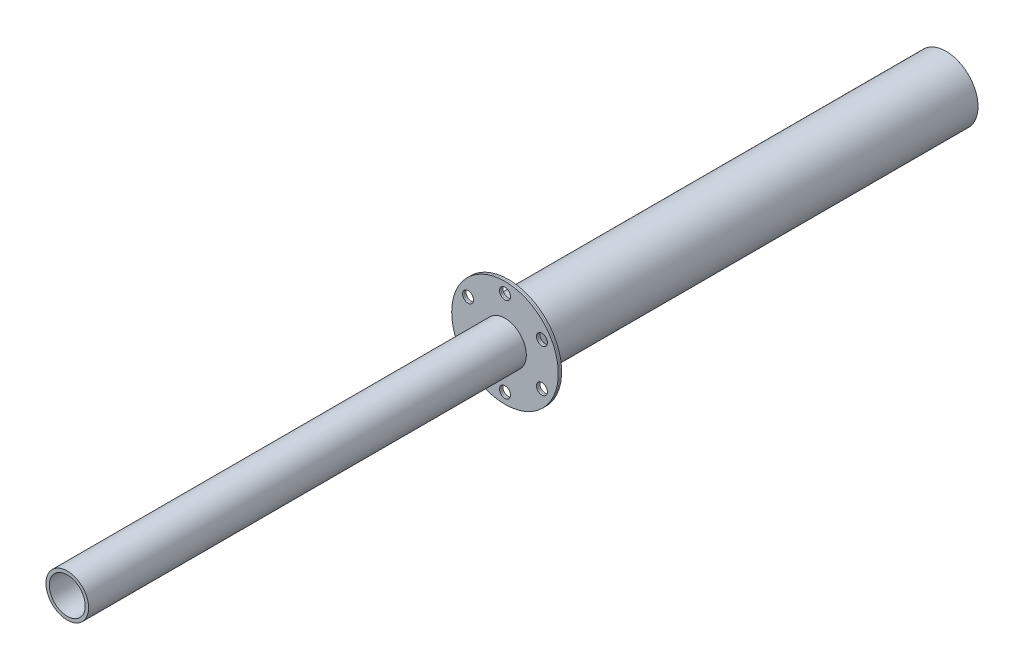
ISO-10303-21;
HEADER;
FILE_DESCRIPTION(('STEP AP214'),'2;1');
FILE_NAME('part.step','',(''),(''),'','','');
FILE_SCHEMA(('AUTOMOTIVE_DESIGN { 1 0 10303 214 1 1 1 1 }'));
ENDSEC;
DATA;
#1=APPLICATION_CONTEXT('core data for automotive mechanical design processes');
#2=APPLICATION_PROTOCOL_DEFINITION('international standard','automotive_design',2000,#1);
#3=PRODUCT_CONTEXT('',#1,'mechanical');
#4=PRODUCT('Part','Part','',(#3));
#5=PRODUCT_RELATED_PRODUCT_CATEGORY('part','',(#4));
#6=PRODUCT_DEFINITION_FORMATION('','',#4);
#7=PRODUCT_DEFINITION_CONTEXT('part definition',#1,'design');
#8=PRODUCT_DEFINITION('design','',#6,#7);
#9=PRODUCT_DEFINITION_SHAPE('','',#8);
#10=(LENGTH_UNIT() NAMED_UNIT(*) SI_UNIT(.MILLI.,.METRE.));
#11=(NAMED_UNIT(*) PLANE_ANGLE_UNIT() SI_UNIT($,.RADIAN.));
#12=(NAMED_UNIT(*) SI_UNIT($,.STERADIAN.) SOLID_ANGLE_UNIT());
#13=UNCERTAINTY_MEASURE_WITH_UNIT(LENGTH_MEASURE(1.E-05),#10,'distance_accuracy_value','');
#14=(GEOMETRIC_REPRESENTATION_CONTEXT(3) GLOBAL_UNCERTAINTY_ASSIGNED_CONTEXT((#13)) GLOBAL_UNIT_ASSIGNED_CONTEXT((#10,
#11,#12)) REPRESENTATION_CONTEXT('',''));
#15=CARTESIAN_POINT('',(0.,0.,0.));
#16=DIRECTION('',(0.,0.,1.));
#17=DIRECTION('',(1.,0.,0.));
#18=AXIS2_PLACEMENT_3D('',#15,#16,#17);
#19=CARTESIAN_POINT('',(0.,0.,-262.7));
#20=DIRECTION('',(0.,0.,-1.));
#21=DIRECTION('',(-1.,0.,0.));
#22=AXIS2_PLACEMENT_3D('',#19,#20,#21);
#23=PLANE('',#22);
#24=CARTESIAN_POINT('',(0.,-25.4,-262.7));
#25=DIRECTION('',(0.,0.,-1.));
#26=DIRECTION('',(-1.,0.,0.));
#27=AXIS2_PLACEMENT_3D('',#24,#25,#26);
#28=CIRCLE('',#27,3.2639);
#29=CARTESIAN_POINT('',(-3.26390000000001,-25.4,-262.7));
#30=VERTEX_POINT('',#29);
#31=EDGE_CURVE('E83',#30,#30,#28,.T.);
#32=ORIENTED_EDGE('',*,*,#31,.F.);
#33=EDGE_LOOP('',(#32));
#34=FACE_BOUND('',#33,.T.);
#35=CARTESIAN_POINT('',(-21.9970452561247,12.7,-262.7));
#36=DIRECTION('',(0.,0.,-1.));
#37=DIRECTION('',(-1.,0.,0.));
#38=AXIS2_PLACEMENT_3D('',#35,#36,#37);
#39=CIRCLE('',#38,3.2639);
#40=CARTESIAN_POINT('',(-25.2609452561247,12.7,-262.7));
#41=VERTEX_POINT('',#40);
#42=EDGE_CURVE('E71',#41,#41,#39,.T.);
#43=ORIENTED_EDGE('',*,*,#42,.F.);
#44=EDGE_LOOP('',(#43));
#45=FACE_BOUND('',#44,.T.);
#46=CARTESIAN_POINT('',(0.,25.4,-262.7));
#47=DIRECTION('',(0.,0.,-1.));
#48=DIRECTION('',(-1.,0.,0.));
#49=AXIS2_PLACEMENT_3D('',#46,#47,#48);
#50=CIRCLE('',#49,3.2639);
#51=CARTESIAN_POINT('',(-3.2639,25.4,-262.7));
#52=VERTEX_POINT('',#51);
#53=EDGE_CURVE('E59',#52,#52,#50,.T.);
#54=ORIENTED_EDGE('',*,*,#53,.F.);
#55=EDGE_LOOP('',(#54));
#56=FACE_BOUND('',#55,.T.);
#57=CARTESIAN_POINT('',(0.,0.,-262.7));
#58=DIRECTION('',(0.,0.,-1.));
#59=DIRECTION('',(-1.,0.,0.));
#60=AXIS2_PLACEMENT_3D('',#57,#58,#59);
#61=CIRCLE('',#60,31.75);
#62=CARTESIAN_POINT('',(-31.75,0.,-262.7));
#63=VERTEX_POINT('',#62);
#64=EDGE_CURVE('E11',#63,#63,#61,.T.);
#65=ORIENTED_EDGE('',*,*,#64,.T.);
#66=EDGE_LOOP('',(#65));
#67=FACE_BOUND('',#66,.T.);
#68=CARTESIAN_POINT('',(21.9970452561247,12.7,-262.7));
#69=DIRECTION('',(0.,0.,-1.));
#70=DIRECTION('',(-1.,0.,0.));
#71=AXIS2_PLACEMENT_3D('',#68,#69,#70);
#72=CIRCLE('',#71,3.2639);
#73=CARTESIAN_POINT('',(18.7331452561247,12.7,-262.7));
#74=VERTEX_POINT('',#73);
#75=EDGE_CURVE('E54',#74,#74,#72,.T.);
#76=ORIENTED_EDGE('',*,*,#75,.F.);
#77=EDGE_LOOP('',(#76));
#78=FACE_BOUND('',#77,.T.);
#79=CARTESIAN_POINT('',(21.9970452561247,-12.7,-262.7));
#80=DIRECTION('',(0.,0.,-1.));
#81=DIRECTION('',(-1.,0.,0.));
#82=AXIS2_PLACEMENT_3D('',#79,#80,#81);
#83=CIRCLE('',#82,3.2639);
#84=CARTESIAN_POINT('',(18.7331452561247,-12.7,-262.7));
#85=VERTEX_POINT('',#84);
#86=EDGE_CURVE('E65',#85,#85,#83,.T.);
#87=ORIENTED_EDGE('',*,*,#86,.F.);
#88=EDGE_LOOP('',(#87));
#89=FACE_BOUND('',#88,.T.);
#90=CARTESIAN_POINT('',(-21.9970452561248,-12.7,-262.7));
#91=DIRECTION('',(0.,0.,-1.));
#92=DIRECTION('',(-1.,0.,0.));
#93=AXIS2_PLACEMENT_3D('',#90,#91,#92);
#94=CIRCLE('',#93,3.2639);
#95=CARTESIAN_POINT('',(-25.2609452561248,-12.7,-262.7));
#96=VERTEX_POINT('',#95);
#97=EDGE_CURVE('E77',#96,#96,#94,.T.);
#98=ORIENTED_EDGE('',*,*,#97,.F.);
#99=EDGE_LOOP('',(#98));
#100=FACE_BOUND('',#99,.T.);
#101=CARTESIAN_POINT('',(0.,0.,-262.7));
#102=DIRECTION('',(0.,0.,-1.));
#103=DIRECTION('',(-1.,0.,0.));
#104=AXIS2_PLACEMENT_3D('',#101,#102,#103);
#105=CIRCLE('',#104,19.05);
#106=CARTESIAN_POINT('',(-19.05,0.,-262.7));
#107=VERTEX_POINT('',#106);
#108=EDGE_CURVE('E89',#107,#107,#105,.T.);
#109=ORIENTED_EDGE('',*,*,#108,.F.);
#110=EDGE_LOOP('',(#109));
#111=FACE_BOUND('',#110,.T.);
#112=ADVANCED_FACE('F43',(#34,#45,#56,#67,#78,#89,#100,#111),#23,.T.);
#113=CARTESIAN_POINT('',(0.,0.,-261.7));
#114=DIRECTION('',(0.,0.,-1.));
#115=DIRECTION('',(-1.,0.,0.));
#116=AXIS2_PLACEMENT_3D('',#113,#114,#115);
#117=PLANE('',#116);
#118=CARTESIAN_POINT('',(0.,-25.4,-261.7));
#119=DIRECTION('',(0.,0.,-1.));
#120=DIRECTION('',(-1.,0.,0.));
#121=AXIS2_PLACEMENT_3D('',#118,#119,#120);
#122=CIRCLE('',#121,3.2639);
#123=CARTESIAN_POINT('',(-3.26390000000001,-25.4,-261.7));
#124=VERTEX_POINT('',#123);
#125=EDGE_CURVE('E86',#124,#124,#122,.T.);
#126=ORIENTED_EDGE('',*,*,#125,.T.);
#127=EDGE_LOOP('',(#126));
#128=FACE_BOUND('',#127,.T.);
#129=CARTESIAN_POINT('',(-21.9970452561247,12.7,-261.7));
#130=DIRECTION('',(0.,0.,-1.));
#131=DIRECTION('',(-1.,0.,0.));
#132=AXIS2_PLACEMENT_3D('',#129,#130,#131);
#133=CIRCLE('',#132,3.2639);
#134=CARTESIAN_POINT('',(-25.2609452561247,12.7,-261.7));
#135=VERTEX_POINT('',#134);
#136=EDGE_CURVE('E74',#135,#135,#133,.T.);
#137=ORIENTED_EDGE('',*,*,#136,.T.);
#138=EDGE_LOOP('',(#137));
#139=FACE_BOUND('',#138,.T.);
#140=CARTESIAN_POINT('',(0.,25.4,-261.7));
#141=DIRECTION('',(0.,0.,-1.));
#142=DIRECTION('',(-1.,0.,0.));
#143=AXIS2_PLACEMENT_3D('',#140,#141,#142);
#144=CIRCLE('',#143,3.2639);
#145=CARTESIAN_POINT('',(-3.2639,25.4,-261.7));
#146=VERTEX_POINT('',#145);
#147=EDGE_CURVE('E62',#146,#146,#144,.T.);
#148=ORIENTED_EDGE('',*,*,#147,.T.);
#149=EDGE_LOOP('',(#148));
#150=FACE_BOUND('',#149,.T.);
#151=CARTESIAN_POINT('',(0.,0.,-261.7));
#152=DIRECTION('',(0.,0.,-1.));
#153=DIRECTION('',(-1.,0.,0.));
#154=AXIS2_PLACEMENT_3D('',#151,#152,#153);
#155=CIRCLE('',#154,31.75);
#156=CARTESIAN_POINT('',(-31.75,0.,-261.7));
#157=VERTEX_POINT('',#156);
#158=EDGE_CURVE('E47',#157,#157,#155,.T.);
#159=ORIENTED_EDGE('',*,*,#158,.F.);
#160=EDGE_LOOP('',(#159));
#161=FACE_BOUND('',#160,.T.);
#162=CARTESIAN_POINT('',(21.9970452561247,12.7,-261.7));
#163=DIRECTION('',(0.,0.,-1.));
#164=DIRECTION('',(-1.,0.,0.));
#165=AXIS2_PLACEMENT_3D('',#162,#163,#164);
#166=CIRCLE('',#165,3.2639);
#167=CARTESIAN_POINT('',(18.7331452561247,12.7,-261.7));
#168=VERTEX_POINT('',#167);
#169=EDGE_CURVE('E56',#168,#168,#166,.T.);
#170=ORIENTED_EDGE('',*,*,#169,.T.);
#171=EDGE_LOOP('',(#170));
#172=FACE_BOUND('',#171,.T.);
#173=CARTESIAN_POINT('',(21.9970452561247,-12.7,-261.7));
#174=DIRECTION('',(0.,0.,-1.));
#175=DIRECTION('',(-1.,0.,0.));
#176=AXIS2_PLACEMENT_3D('',#173,#174,#175);
#177=CIRCLE('',#176,3.2639);
#178=CARTESIAN_POINT('',(18.7331452561247,-12.7,-261.7));
#179=VERTEX_POINT('',#178);
#180=EDGE_CURVE('E68',#179,#179,#177,.T.);
#181=ORIENTED_EDGE('',*,*,#180,.T.);
#182=EDGE_LOOP('',(#181));
#183=FACE_BOUND('',#182,.T.);
#184=CARTESIAN_POINT('',(-21.9970452561248,-12.7,-261.7));
#185=DIRECTION('',(0.,0.,-1.));
#186=DIRECTION('',(-1.,0.,0.));
#187=AXIS2_PLACEMENT_3D('',#184,#185,#186);
#188=CIRCLE('',#187,3.2639);
#189=CARTESIAN_POINT('',(-25.2609452561248,-12.7,-261.7));
#190=VERTEX_POINT('',#189);
#191=EDGE_CURVE('E80',#190,#190,#188,.T.);
#192=ORIENTED_EDGE('',*,*,#191,.T.);
#193=EDGE_LOOP('',(#192));
#194=FACE_BOUND('',#193,.T.);
#195=CARTESIAN_POINT('',(0.,0.,-261.7));
#196=DIRECTION('',(0.,0.,-1.));
#197=DIRECTION('',(-1.,0.,0.));
#198=AXIS2_PLACEMENT_3D('',#195,#196,#197);
#199=CIRCLE('',#198,19.05);
#200=CARTESIAN_POINT('',(-19.05,0.,-261.7));
#201=VERTEX_POINT('',#200);
#202=EDGE_CURVE('E92',#201,#201,#199,.T.);
#203=ORIENTED_EDGE('',*,*,#202,.T.);
#204=EDGE_LOOP('',(#203));
#205=FACE_BOUND('',#204,.T.);
#206=ADVANCED_FACE('F102',(#128,#139,#150,#161,#172,#183,#194,#205),#117,.F.);
#207=CARTESIAN_POINT('',(0.,0.,-262.7));
#208=DIRECTION('',(0.,0.,1.));
#209=DIRECTION('',(1.,0.,0.));
#210=AXIS2_PLACEMENT_3D('',#207,#208,#209);
#211=CYLINDRICAL_SURFACE('',#210,31.75);
#212=ORIENTED_EDGE('',*,*,#64,.F.);
#213=EDGE_LOOP('',(#212));
#214=FACE_BOUND('',#213,.T.);
#215=ORIENTED_EDGE('',*,*,#158,.T.);
#216=EDGE_LOOP('',(#215));
#217=FACE_BOUND('',#216,.T.);
#218=ADVANCED_FACE('F45',(#214,#217),#211,.T.);
#219=CARTESIAN_POINT('',(21.9970452561247,12.7,-262.7));
#220=DIRECTION('',(0.,0.,1.));
#221=DIRECTION('',(1.,0.,0.));
#222=AXIS2_PLACEMENT_3D('',#219,#220,#221);
#223=CYLINDRICAL_SURFACE('',#222,3.2639);
#224=ORIENTED_EDGE('',*,*,#75,.T.);
#225=EDGE_LOOP('',(#224));
#226=FACE_BOUND('',#225,.T.);
#227=ORIENTED_EDGE('',*,*,#169,.F.);
#228=EDGE_LOOP('',(#227));
#229=FACE_BOUND('',#228,.T.);
#230=ADVANCED_FACE('F112',(#226,#229),#223,.F.);
#231=CARTESIAN_POINT('',(0.,25.4,-262.7));
#232=DIRECTION('',(0.,0.,1.));
#233=DIRECTION('',(1.,0.,0.));
#234=AXIS2_PLACEMENT_3D('',#231,#232,#233);
#235=CYLINDRICAL_SURFACE('',#234,3.2639);
#236=ORIENTED_EDGE('',*,*,#53,.T.);
#237=EDGE_LOOP('',(#236));
#238=FACE_BOUND('',#237,.T.);
#239=ORIENTED_EDGE('',*,*,#147,.F.);
#240=EDGE_LOOP('',(#239));
#241=FACE_BOUND('',#240,.T.);
#242=ADVANCED_FACE('F115',(#238,#241),#235,.F.);
#243=CARTESIAN_POINT('',(21.9970452561247,-12.7,-262.7));
#244=DIRECTION('',(0.,0.,1.));
#245=DIRECTION('',(1.,0.,0.));
#246=AXIS2_PLACEMENT_3D('',#243,#244,#245);
#247=CYLINDRICAL_SURFACE('',#246,3.2639);
#248=ORIENTED_EDGE('',*,*,#86,.T.);
#249=EDGE_LOOP('',(#248));
#250=FACE_BOUND('',#249,.T.);
#251=ORIENTED_EDGE('',*,*,#180,.F.);
#252=EDGE_LOOP('',(#251));
#253=FACE_BOUND('',#252,.T.);
#254=ADVANCED_FACE('F119',(#250,#253),#247,.F.);
#255=CARTESIAN_POINT('',(-21.9970452561247,12.7,-262.7));
#256=DIRECTION('',(0.,0.,1.));
#257=DIRECTION('',(1.,0.,0.));
#258=AXIS2_PLACEMENT_3D('',#255,#256,#257);
#259=CYLINDRICAL_SURFACE('',#258,3.2639);
#260=ORIENTED_EDGE('',*,*,#42,.T.);
#261=EDGE_LOOP('',(#260));
#262=FACE_BOUND('',#261,.T.);
#263=ORIENTED_EDGE('',*,*,#136,.F.);
#264=EDGE_LOOP('',(#263));
#265=FACE_BOUND('',#264,.T.);
#266=ADVANCED_FACE('F123',(#262,#265),#259,.F.);
#267=CARTESIAN_POINT('',(-21.9970452561248,-12.7,-262.7));
#268=DIRECTION('',(0.,0.,1.));
#269=DIRECTION('',(1.,0.,0.));
#270=AXIS2_PLACEMENT_3D('',#267,#268,#269);
#271=CYLINDRICAL_SURFACE('',#270,3.2639);
#272=ORIENTED_EDGE('',*,*,#97,.T.);
#273=EDGE_LOOP('',(#272));
#274=FACE_BOUND('',#273,.T.);
#275=ORIENTED_EDGE('',*,*,#191,.F.);
#276=EDGE_LOOP('',(#275));
#277=FACE_BOUND('',#276,.T.);
#278=ADVANCED_FACE('F127',(#274,#277),#271,.F.);
#279=CARTESIAN_POINT('',(0.,-25.4,-262.7));
#280=DIRECTION('',(0.,0.,1.));
#281=DIRECTION('',(1.,0.,0.));
#282=AXIS2_PLACEMENT_3D('',#279,#280,#281);
#283=CYLINDRICAL_SURFACE('',#282,3.2639);
#284=ORIENTED_EDGE('',*,*,#31,.T.);
#285=EDGE_LOOP('',(#284));
#286=FACE_BOUND('',#285,.T.);
#287=ORIENTED_EDGE('',*,*,#125,.F.);
#288=EDGE_LOOP('',(#287));
#289=FACE_BOUND('',#288,.T.);
#290=ADVANCED_FACE('F131',(#286,#289),#283,.F.);
#291=CARTESIAN_POINT('',(0.,0.,-262.7));
#292=DIRECTION('',(0.,0.,1.));
#293=DIRECTION('',(1.,0.,0.));
#294=AXIS2_PLACEMENT_3D('',#291,#292,#293);
#295=CYLINDRICAL_SURFACE('',#294,19.05);
#296=ORIENTED_EDGE('',*,*,#108,.T.);
#297=EDGE_LOOP('',(#296));
#298=FACE_BOUND('',#297,.T.);
#299=ORIENTED_EDGE('',*,*,#202,.F.);
#300=EDGE_LOOP('',(#299));
#301=FACE_BOUND('',#300,.T.);
#302=ADVANCED_FACE('F98',(#298,#301),#295,.F.);
#303=CLOSED_SHELL('',(#112,#206,#218,#230,#242,#254,#266,#278,#290,#302));
#304=MANIFOLD_SOLID_BREP('B2',#303);
#305=CARTESIAN_POINT('',(0.,0.,-523.4));
#306=DIRECTION('',(0.,0.,-1.));
#307=DIRECTION('',(-1.,0.,0.));
#308=AXIS2_PLACEMENT_3D('',#305,#306,#307);
#309=PLANE('',#308);
#310=CARTESIAN_POINT('',(0.,0.,-523.4));
#311=DIRECTION('',(0.,0.,-1.));
#312=DIRECTION('',(-1.,0.,0.));
#313=AXIS2_PLACEMENT_3D('',#310,#311,#312);
#314=CIRCLE('',#313,19.05);
#315=CARTESIAN_POINT('',(-19.05,0.,-523.4));
#316=VERTEX_POINT('',#315);
#317=EDGE_CURVE('E42',#316,#316,#314,.T.);
#318=ORIENTED_EDGE('',*,*,#317,.T.);
#319=EDGE_LOOP('',(#318));
#320=FACE_BOUND('',#319,.T.);
#321=CARTESIAN_POINT('',(0.,0.,-523.4));
#322=DIRECTION('',(0.,0.,-1.));
#323=DIRECTION('',(-1.,0.,0.));
#324=AXIS2_PLACEMENT_3D('',#321,#322,#323);
#325=CIRCLE('',#324,17.85);
#326=CARTESIAN_POINT('',(-17.85,0.,-523.4));
#327=VERTEX_POINT('',#326);
#328=EDGE_CURVE('E249',#327,#327,#325,.T.);
#329=ORIENTED_EDGE('',*,*,#328,.F.);
#330=EDGE_LOOP('',(#329));
#331=FACE_BOUND('',#330,.T.);
#332=ADVANCED_FACE('F238',(#320,#331),#309,.T.);
#333=CARTESIAN_POINT('',(0.,0.,-261.7));
#334=DIRECTION('',(0.,0.,-1.));
#335=DIRECTION('',(-1.,0.,0.));
#336=AXIS2_PLACEMENT_3D('',#333,#334,#335);
#337=PLANE('',#336);
#338=CARTESIAN_POINT('',(0.,0.,-261.7));
#339=DIRECTION('',(0.,0.,-1.));
#340=DIRECTION('',(-1.,0.,0.));
#341=AXIS2_PLACEMENT_3D('',#338,#339,#340);
#342=CIRCLE('',#341,19.05);
#343=CARTESIAN_POINT('',(-19.05,0.,-261.7));
#344=VERTEX_POINT('',#343);
#345=EDGE_CURVE('E242',#344,#344,#342,.T.);
#346=ORIENTED_EDGE('',*,*,#345,.F.);
#347=EDGE_LOOP('',(#346));
#348=FACE_BOUND('',#347,.T.);
#349=CARTESIAN_POINT('',(0.,0.,-261.7));
#350=DIRECTION('',(0.,0.,-1.));
#351=DIRECTION('',(-1.,0.,0.));
#352=AXIS2_PLACEMENT_3D('',#349,#350,#351);
#353=CIRCLE('',#352,17.85);
#354=CARTESIAN_POINT('',(-17.85,0.,-261.7));
#355=VERTEX_POINT('',#354);
#356=EDGE_CURVE('E251',#355,#355,#353,.T.);
#357=ORIENTED_EDGE('',*,*,#356,.T.);
#358=EDGE_LOOP('',(#357));
#359=FACE_BOUND('',#358,.T.);
#360=ADVANCED_FACE('F261',(#348,#359),#337,.F.);
#361=CARTESIAN_POINT('',(0.,0.,-523.4));
#362=DIRECTION('',(0.,0.,1.));
#363=DIRECTION('',(1.,0.,0.));
#364=AXIS2_PLACEMENT_3D('',#361,#362,#363);
#365=CYLINDRICAL_SURFACE('',#364,19.05);
#366=ORIENTED_EDGE('',*,*,#317,.F.);
#367=EDGE_LOOP('',(#366));
#368=FACE_BOUND('',#367,.T.);
#369=ORIENTED_EDGE('',*,*,#345,.T.);
#370=EDGE_LOOP('',(#369));
#371=FACE_BOUND('',#370,.T.);
#372=ADVANCED_FACE('F240',(#368,#371),#365,.T.);
#373=CARTESIAN_POINT('',(0.,0.,-523.4));
#374=DIRECTION('',(0.,0.,1.));
#375=DIRECTION('',(1.,0.,0.));
#376=AXIS2_PLACEMENT_3D('',#373,#374,#375);
#377=CYLINDRICAL_SURFACE('',#376,17.85);
#378=ORIENTED_EDGE('',*,*,#328,.T.);
#379=EDGE_LOOP('',(#378));
#380=FACE_BOUND('',#379,.T.);
#381=ORIENTED_EDGE('',*,*,#356,.F.);
#382=EDGE_LOOP('',(#381));
#383=FACE_BOUND('',#382,.T.);
#384=ADVANCED_FACE('F257',(#380,#383),#377,.F.);
#385=CLOSED_SHELL('',(#332,#360,#372,#384));
#386=MANIFOLD_SOLID_BREP('B6',#385);
#387=CARTESIAN_POINT('',(0.,0.,-260.7));
#388=DIRECTION('',(0.,0.,-1.));
#389=DIRECTION('',(-1.,0.,0.));
#390=AXIS2_PLACEMENT_3D('',#387,#388,#389);
#391=CYLINDRICAL_SURFACE('',#390,31.75);
#392=CARTESIAN_POINT('',(0.,0.,-260.7));
#393=DIRECTION('',(0.,0.,-1.));
#394=DIRECTION('',(-1.,0.,0.));
#395=AXIS2_PLACEMENT_3D('',#392,#393,#394);
#396=CIRCLE('',#395,31.75);
#397=CARTESIAN_POINT('',(-31.75,0.,-260.7));
#398=VERTEX_POINT('',#397);
#399=EDGE_CURVE('E237',#398,#398,#396,.T.);
#400=ORIENTED_EDGE('',*,*,#399,.T.);
#401=EDGE_LOOP('',(#400));
#402=FACE_BOUND('',#401,.T.);
#403=CARTESIAN_POINT('',(0.,0.,-261.7));
#404=DIRECTION('',(0.,0.,-1.));
#405=DIRECTION('',(-1.,0.,0.));
#406=AXIS2_PLACEMENT_3D('',#403,#404,#405);
#407=CIRCLE('',#406,31.75);
#408=CARTESIAN_POINT('',(-31.75,0.,-261.7));
#409=VERTEX_POINT('',#408);
#410=EDGE_CURVE('E309',#409,#409,#407,.T.);
#411=ORIENTED_EDGE('',*,*,#410,.F.);
#412=EDGE_LOOP('',(#411));
#413=FACE_BOUND('',#412,.T.);
#414=ADVANCED_FACE('F306',(#402,#413),#391,.T.);
#415=CARTESIAN_POINT('',(0.,0.,-260.7));
#416=DIRECTION('',(0.,0.,-1.));
#417=DIRECTION('',(-1.,0.,0.));
#418=AXIS2_PLACEMENT_3D('',#415,#416,#417);
#419=PLANE('',#418);
#420=CARTESIAN_POINT('',(21.9970452561247,12.7,-260.7));
#421=DIRECTION('',(0.,0.,-1.));
#422=DIRECTION('',(-1.,0.,0.));
#423=AXIS2_PLACEMENT_3D('',#420,#421,#422);
#424=CIRCLE('',#423,3.2639);
#425=CARTESIAN_POINT('',(18.7331452561247,12.7,-260.7));
#426=VERTEX_POINT('',#425);
#427=EDGE_CURVE('E351',#426,#426,#424,.T.);
#428=ORIENTED_EDGE('',*,*,#427,.T.);
#429=EDGE_LOOP('',(#428));
#430=FACE_BOUND('',#429,.T.);
#431=CARTESIAN_POINT('',(21.9970452561247,-12.7,-260.7));
#432=DIRECTION('',(0.,0.,-1.));
#433=DIRECTION('',(-1.,0.,0.));
#434=AXIS2_PLACEMENT_3D('',#431,#432,#433);
#435=CIRCLE('',#434,3.2639);
#436=CARTESIAN_POINT('',(18.7331452561247,-12.7,-260.7));
#437=VERTEX_POINT('',#436);
#438=EDGE_CURVE('E345',#437,#437,#435,.T.);
#439=ORIENTED_EDGE('',*,*,#438,.T.);
#440=EDGE_LOOP('',(#439));
#441=FACE_BOUND('',#440,.T.);
#442=CARTESIAN_POINT('',(0.,-25.4,-260.7));
#443=DIRECTION('',(0.,0.,-1.));
#444=DIRECTION('',(-1.,0.,0.));
#445=AXIS2_PLACEMENT_3D('',#442,#443,#444);
#446=CIRCLE('',#445,3.2639);
#447=CARTESIAN_POINT('',(-3.26390000000001,-25.4,-260.7));
#448=VERTEX_POINT('',#447);
#449=EDGE_CURVE('E339',#448,#448,#446,.T.);
#450=ORIENTED_EDGE('',*,*,#449,.T.);
#451=EDGE_LOOP('',(#450));
#452=FACE_BOUND('',#451,.T.);
#453=CARTESIAN_POINT('',(-21.9970452561248,-12.7,-260.7));
#454=DIRECTION('',(0.,0.,-1.));
#455=DIRECTION('',(-1.,0.,0.));
#456=AXIS2_PLACEMENT_3D('',#453,#454,#455);
#457=CIRCLE('',#456,3.2639);
#458=CARTESIAN_POINT('',(-25.2609452561248,-12.7,-260.7));
#459=VERTEX_POINT('',#458);
#460=EDGE_CURVE('E333',#459,#459,#457,.T.);
#461=ORIENTED_EDGE('',*,*,#460,.T.);
#462=EDGE_LOOP('',(#461));
#463=FACE_BOUND('',#462,.T.);
#464=CARTESIAN_POINT('',(-21.9970452561247,12.7,-260.7));
#465=DIRECTION('',(0.,0.,-1.));
#466=DIRECTION('',(-1.,0.,0.));
#467=AXIS2_PLACEMENT_3D('',#464,#465,#466);
#468=CIRCLE('',#467,3.2639);
#469=CARTESIAN_POINT('',(-25.2609452561247,12.7,-260.7));
#470=VERTEX_POINT('',#469);
#471=EDGE_CURVE('E327',#470,#470,#468,.T.);
#472=ORIENTED_EDGE('',*,*,#471,.T.);
#473=EDGE_LOOP('',(#472));
#474=FACE_BOUND('',#473,.T.);
#475=CARTESIAN_POINT('',(0.,25.4,-260.7));
#476=DIRECTION('',(0.,0.,-1.));
#477=DIRECTION('',(-1.,0.,0.));
#478=AXIS2_PLACEMENT_3D('',#475,#476,#477);
#479=CIRCLE('',#478,3.2639);
#480=CARTESIAN_POINT('',(-3.2639,25.4,-260.7));
#481=VERTEX_POINT('',#480);
#482=EDGE_CURVE('E321',#481,#481,#479,.T.);
#483=ORIENTED_EDGE('',*,*,#482,.T.);
#484=EDGE_LOOP('',(#483));
#485=FACE_BOUND('',#484,.T.);
#486=CARTESIAN_POINT('',(0.,0.,-260.7));
#487=DIRECTION('',(0.,0.,-1.));
#488=DIRECTION('',(-1.,0.,0.));
#489=AXIS2_PLACEMENT_3D('',#486,#487,#488);
#490=CIRCLE('',#489,12.7);
#491=CARTESIAN_POINT('',(-12.7,0.,-260.7));
#492=VERTEX_POINT('',#491);
#493=EDGE_CURVE('E316',#492,#492,#490,.T.);
#494=ORIENTED_EDGE('',*,*,#493,.T.);
#495=EDGE_LOOP('',(#494));
#496=FACE_BOUND('',#495,.T.);
#497=ORIENTED_EDGE('',*,*,#399,.F.);
#498=EDGE_LOOP('',(#497));
#499=FACE_BOUND('',#498,.T.);
#500=ADVANCED_FACE('F360',(#430,#441,#452,#463,#474,#485,#496,#499),#419,.F.);
#501=CARTESIAN_POINT('',(0.,0.,-261.7));
#502=DIRECTION('',(0.,0.,-1.));
#503=DIRECTION('',(-1.,0.,0.));
#504=AXIS2_PLACEMENT_3D('',#501,#502,#503);
#505=PLANE('',#504);
#506=CARTESIAN_POINT('',(21.9970452561247,12.7,-261.7));
#507=DIRECTION('',(0.,0.,-1.));
#508=DIRECTION('',(-1.,0.,0.));
#509=AXIS2_PLACEMENT_3D('',#506,#507,#508);
#510=CIRCLE('',#509,3.2639);
#511=CARTESIAN_POINT('',(18.7331452561247,12.7,-261.7));
#512=VERTEX_POINT('',#511);
#513=EDGE_CURVE('E354',#512,#512,#510,.T.);
#514=ORIENTED_EDGE('',*,*,#513,.F.);
#515=EDGE_LOOP('',(#514));
#516=FACE_BOUND('',#515,.T.);
#517=CARTESIAN_POINT('',(21.9970452561247,-12.7,-261.7));
#518=DIRECTION('',(0.,0.,-1.));
#519=DIRECTION('',(-1.,0.,0.));
#520=AXIS2_PLACEMENT_3D('',#517,#518,#519);
#521=CIRCLE('',#520,3.2639);
#522=CARTESIAN_POINT('',(18.7331452561247,-12.7,-261.7));
#523=VERTEX_POINT('',#522);
#524=EDGE_CURVE('E348',#523,#523,#521,.T.);
#525=ORIENTED_EDGE('',*,*,#524,.F.);
#526=EDGE_LOOP('',(#525));
#527=FACE_BOUND('',#526,.T.);
#528=CARTESIAN_POINT('',(0.,-25.4,-261.7));
#529=DIRECTION('',(0.,0.,-1.));
#530=DIRECTION('',(-1.,0.,0.));
#531=AXIS2_PLACEMENT_3D('',#528,#529,#530);
#532=CIRCLE('',#531,3.2639);
#533=CARTESIAN_POINT('',(-3.26390000000001,-25.4,-261.7));
#534=VERTEX_POINT('',#533);
#535=EDGE_CURVE('E342',#534,#534,#532,.T.);
#536=ORIENTED_EDGE('',*,*,#535,.F.);
#537=EDGE_LOOP('',(#536));
#538=FACE_BOUND('',#537,.T.);
#539=CARTESIAN_POINT('',(-21.9970452561248,-12.7,-261.7));
#540=DIRECTION('',(0.,0.,-1.));
#541=DIRECTION('',(-1.,0.,0.));
#542=AXIS2_PLACEMENT_3D('',#539,#540,#541);
#543=CIRCLE('',#542,3.2639);
#544=CARTESIAN_POINT('',(-25.2609452561248,-12.7,-261.7));
#545=VERTEX_POINT('',#544);
#546=EDGE_CURVE('E336',#545,#545,#543,.T.);
#547=ORIENTED_EDGE('',*,*,#546,.F.);
#548=EDGE_LOOP('',(#547));
#549=FACE_BOUND('',#548,.T.);
#550=CARTESIAN_POINT('',(-21.9970452561247,12.7,-261.7));
#551=DIRECTION('',(0.,0.,-1.));
#552=DIRECTION('',(-1.,0.,0.));
#553=AXIS2_PLACEMENT_3D('',#550,#551,#552);
#554=CIRCLE('',#553,3.2639);
#555=CARTESIAN_POINT('',(-25.2609452561247,12.7,-261.7));
#556=VERTEX_POINT('',#555);
#557=EDGE_CURVE('E330',#556,#556,#554,.T.);
#558=ORIENTED_EDGE('',*,*,#557,.F.);
#559=EDGE_LOOP('',(#558));
#560=FACE_BOUND('',#559,.T.);
#561=CARTESIAN_POINT('',(0.,25.4,-261.7));
#562=DIRECTION('',(0.,0.,-1.));
#563=DIRECTION('',(-1.,0.,0.));
#564=AXIS2_PLACEMENT_3D('',#561,#562,#563);
#565=CIRCLE('',#564,3.2639);
#566=CARTESIAN_POINT('',(-3.2639,25.4,-261.7));
#567=VERTEX_POINT('',#566);
#568=EDGE_CURVE('E324',#567,#567,#565,.T.);
#569=ORIENTED_EDGE('',*,*,#568,.F.);
#570=EDGE_LOOP('',(#569));
#571=FACE_BOUND('',#570,.T.);
#572=CARTESIAN_POINT('',(0.,0.,-261.7));
#573=DIRECTION('',(0.,0.,-1.));
#574=DIRECTION('',(-1.,0.,0.));
#575=AXIS2_PLACEMENT_3D('',#572,#573,#574);
#576=CIRCLE('',#575,12.7);
#577=CARTESIAN_POINT('',(-12.7,0.,-261.7));
#578=VERTEX_POINT('',#577);
#579=EDGE_CURVE('E318',#578,#578,#576,.T.);
#580=ORIENTED_EDGE('',*,*,#579,.F.);
#581=EDGE_LOOP('',(#580));
#582=FACE_BOUND('',#581,.T.);
#583=ORIENTED_EDGE('',*,*,#410,.T.);
#584=EDGE_LOOP('',(#583));
#585=FACE_BOUND('',#584,.T.);
#586=ADVANCED_FACE('F370',(#516,#527,#538,#549,#560,#571,#582,#585),#505,.T.);
#587=CARTESIAN_POINT('',(0.,0.,-260.7));
#588=DIRECTION('',(0.,0.,-1.));
#589=DIRECTION('',(-1.,0.,0.));
#590=AXIS2_PLACEMENT_3D('',#587,#588,#589);
#591=CYLINDRICAL_SURFACE('',#590,12.7);
#592=ORIENTED_EDGE('',*,*,#493,.F.);
#593=EDGE_LOOP('',(#592));
#594=FACE_BOUND('',#593,.T.);
#595=ORIENTED_EDGE('',*,*,#579,.T.);
#596=EDGE_LOOP('',(#595));
#597=FACE_BOUND('',#596,.T.);
#598=ADVANCED_FACE('F373',(#594,#597),#591,.F.);
#599=CARTESIAN_POINT('',(0.,25.4,-260.7));
#600=DIRECTION('',(0.,0.,-1.));
#601=DIRECTION('',(-1.,0.,0.));
#602=AXIS2_PLACEMENT_3D('',#599,#600,#601);
#603=CYLINDRICAL_SURFACE('',#602,3.2639);
#604=ORIENTED_EDGE('',*,*,#482,.F.);
#605=EDGE_LOOP('',(#604));
#606=FACE_BOUND('',#605,.T.);
#607=ORIENTED_EDGE('',*,*,#568,.T.);
#608=EDGE_LOOP('',(#607));
#609=FACE_BOUND('',#608,.T.);
#610=ADVANCED_FACE('F398',(#606,#609),#603,.F.);
#611=CARTESIAN_POINT('',(-21.9970452561247,12.7,-260.7));
#612=DIRECTION('',(0.,0.,-1.));
#613=DIRECTION('',(-1.,0.,0.));
#614=AXIS2_PLACEMENT_3D('',#611,#612,#613);
#615=CYLINDRICAL_SURFACE('',#614,3.2639);
#616=ORIENTED_EDGE('',*,*,#471,.F.);
#617=EDGE_LOOP('',(#616));
#618=FACE_BOUND('',#617,.T.);
#619=ORIENTED_EDGE('',*,*,#557,.T.);
#620=EDGE_LOOP('',(#619));
#621=FACE_BOUND('',#620,.T.);
#622=ADVANCED_FACE('F402',(#618,#621),#615,.F.);
#623=CARTESIAN_POINT('',(-21.9970452561248,-12.7,-260.7));
#624=DIRECTION('',(0.,0.,-1.));
#625=DIRECTION('',(-1.,0.,0.));
#626=AXIS2_PLACEMENT_3D('',#623,#624,#625);
#627=CYLINDRICAL_SURFACE('',#626,3.2639);
#628=ORIENTED_EDGE('',*,*,#460,.F.);
#629=EDGE_LOOP('',(#628));
#630=FACE_BOUND('',#629,.T.);
#631=ORIENTED_EDGE('',*,*,#546,.T.);
#632=EDGE_LOOP('',(#631));
#633=FACE_BOUND('',#632,.T.);
#634=ADVANCED_FACE('F406',(#630,#633),#627,.F.);
#635=CARTESIAN_POINT('',(0.,-25.4,-260.7));
#636=DIRECTION('',(0.,0.,-1.));
#637=DIRECTION('',(-1.,0.,0.));
#638=AXIS2_PLACEMENT_3D('',#635,#636,#637);
#639=CYLINDRICAL_SURFACE('',#638,3.2639);
#640=ORIENTED_EDGE('',*,*,#449,.F.);
#641=EDGE_LOOP('',(#640));
#642=FACE_BOUND('',#641,.T.);
#643=ORIENTED_EDGE('',*,*,#535,.T.);
#644=EDGE_LOOP('',(#643));
#645=FACE_BOUND('',#644,.T.);
#646=ADVANCED_FACE('F410',(#642,#645),#639,.F.);
#647=CARTESIAN_POINT('',(21.9970452561247,-12.7,-260.7));
#648=DIRECTION('',(0.,0.,-1.));
#649=DIRECTION('',(-1.,0.,0.));
#650=AXIS2_PLACEMENT_3D('',#647,#648,#649);
#651=CYLINDRICAL_SURFACE('',#650,3.2639);
#652=ORIENTED_EDGE('',*,*,#438,.F.);
#653=EDGE_LOOP('',(#652));
#654=FACE_BOUND('',#653,.T.);
#655=ORIENTED_EDGE('',*,*,#524,.T.);
#656=EDGE_LOOP('',(#655));
#657=FACE_BOUND('',#656,.T.);
#658=ADVANCED_FACE('F366',(#654,#657),#651,.F.);
#659=CARTESIAN_POINT('',(21.9970452561247,12.7,-260.7));
#660=DIRECTION('',(0.,0.,-1.));
#661=DIRECTION('',(-1.,0.,0.));
#662=AXIS2_PLACEMENT_3D('',#659,#660,#661);
#663=CYLINDRICAL_SURFACE('',#662,3.2639);
#664=ORIENTED_EDGE('',*,*,#427,.F.);
#665=EDGE_LOOP('',(#664));
#666=FACE_BOUND('',#665,.T.);
#667=ORIENTED_EDGE('',*,*,#513,.T.);
#668=EDGE_LOOP('',(#667));
#669=FACE_BOUND('',#668,.T.);
#670=ADVANCED_FACE('F363',(#666,#669),#663,.F.);
#671=CLOSED_SHELL('',(#414,#500,#586,#598,#610,#622,#634,#646,#658,#670));
#672=MANIFOLD_SOLID_BREP('B37',#671);
#673=CARTESIAN_POINT('',(0.,0.,-261.7));
#674=DIRECTION('',(0.,0.,1.));
#675=DIRECTION('',(1.,0.,0.));
#676=AXIS2_PLACEMENT_3D('',#673,#674,#675);
#677=CYLINDRICAL_SURFACE('',#676,12.7);
#678=CARTESIAN_POINT('',(0.,0.,-261.7));
#679=DIRECTION('',(0.,0.,1.));
#680=DIRECTION('',(1.,0.,0.));
#681=AXIS2_PLACEMENT_3D('',#678,#679,#680);
#682=CIRCLE('',#681,12.7);
#683=CARTESIAN_POINT('',(12.7,0.,-261.7));
#684=VERTEX_POINT('',#683);
#685=EDGE_CURVE('E305',#684,#684,#682,.T.);
#686=ORIENTED_EDGE('',*,*,#685,.T.);
#687=EDGE_LOOP('',(#686));
#688=FACE_BOUND('',#687,.T.);
#689=CARTESIAN_POINT('',(0.,0.,0.));
#690=DIRECTION('',(0.,0.,1.));
#691=DIRECTION('',(1.,0.,0.));
#692=AXIS2_PLACEMENT_3D('',#689,#690,#691);
#693=CIRCLE('',#692,12.7);
#694=CARTESIAN_POINT('',(12.7,0.,0.));
#695=VERTEX_POINT('',#694);
#696=EDGE_CURVE('E496',#695,#695,#693,.T.);
#697=ORIENTED_EDGE('',*,*,#696,.F.);
#698=EDGE_LOOP('',(#697));
#699=FACE_BOUND('',#698,.T.);
#700=ADVANCED_FACE('F493',(#688,#699),#677,.T.);
#701=CARTESIAN_POINT('',(0.,0.,-261.7));
#702=DIRECTION('',(0.,0.,1.));
#703=DIRECTION('',(1.,0.,0.));
#704=AXIS2_PLACEMENT_3D('',#701,#702,#703);
#705=PLANE('',#704);
#706=CARTESIAN_POINT('',(0.,0.,-261.7));
#707=DIRECTION('',(0.,0.,1.));
#708=DIRECTION('',(1.,0.,0.));
#709=AXIS2_PLACEMENT_3D('',#706,#707,#708);
#710=CIRCLE('',#709,10.7);
#711=CARTESIAN_POINT('',(10.7,0.,-261.7));
#712=VERTEX_POINT('',#711);
#713=EDGE_CURVE('E503',#712,#712,#710,.T.);
#714=ORIENTED_EDGE('',*,*,#713,.T.);
#715=EDGE_LOOP('',(#714));
#716=FACE_BOUND('',#715,.T.);
#717=ORIENTED_EDGE('',*,*,#685,.F.);
#718=EDGE_LOOP('',(#717));
#719=FACE_BOUND('',#718,.T.);
#720=ADVANCED_FACE('F511',(#716,#719),#705,.F.);
#721=CARTESIAN_POINT('',(0.,0.,0.));
#722=DIRECTION('',(0.,0.,1.));
#723=DIRECTION('',(1.,0.,0.));
#724=AXIS2_PLACEMENT_3D('',#721,#722,#723);
#725=PLANE('',#724);
#726=CARTESIAN_POINT('',(0.,0.,0.));
#727=DIRECTION('',(0.,0.,1.));
#728=DIRECTION('',(1.,0.,0.));
#729=AXIS2_PLACEMENT_3D('',#726,#727,#728);
#730=CIRCLE('',#729,10.7);
#731=CARTESIAN_POINT('',(10.7,0.,0.));
#732=VERTEX_POINT('',#731);
#733=EDGE_CURVE('E505',#732,#732,#730,.T.);
#734=ORIENTED_EDGE('',*,*,#733,.F.);
#735=EDGE_LOOP('',(#734));
#736=FACE_BOUND('',#735,.T.);
#737=ORIENTED_EDGE('',*,*,#696,.T.);
#738=EDGE_LOOP('',(#737));
#739=FACE_BOUND('',#738,.T.);
#740=ADVANCED_FACE('F517',(#736,#739),#725,.T.);
#741=CARTESIAN_POINT('',(0.,0.,-261.7));
#742=DIRECTION('',(0.,0.,1.));
#743=DIRECTION('',(1.,0.,0.));
#744=AXIS2_PLACEMENT_3D('',#741,#742,#743);
#745=CYLINDRICAL_SURFACE('',#744,10.7);
#746=ORIENTED_EDGE('',*,*,#713,.F.);
#747=EDGE_LOOP('',(#746));
#748=FACE_BOUND('',#747,.T.);
#749=ORIENTED_EDGE('',*,*,#733,.T.);
#750=EDGE_LOOP('',(#749));
#751=FACE_BOUND('',#750,.T.);
#752=ADVANCED_FACE('F514',(#748,#751),#745,.F.);
#753=CLOSED_SHELL('',(#700,#720,#740,#752));
#754=MANIFOLD_SOLID_BREP('B232',#753);
#755=ADVANCED_BREP_SHAPE_REPRESENTATION('',(#18,#304,#386,#672,#754),#14);
#756=SHAPE_DEFINITION_REPRESENTATION(#9,#755);
ENDSEC;
END-ISO-10303-21;
